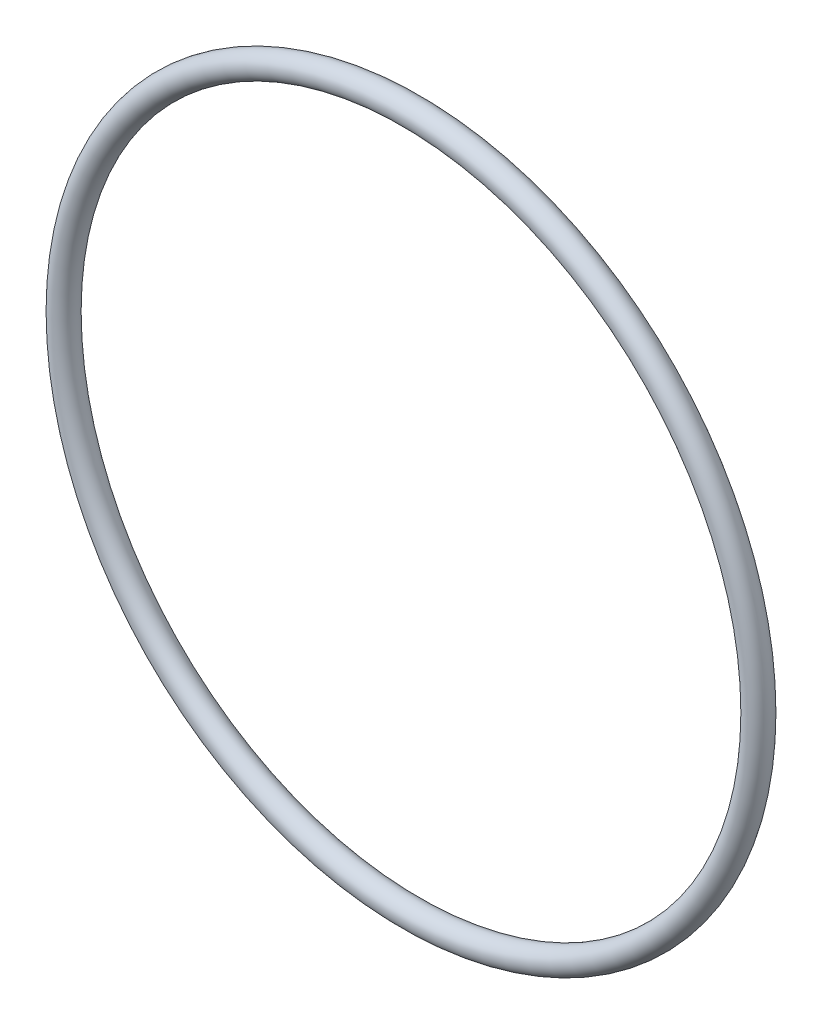
ISO-10303-21;
HEADER;
FILE_DESCRIPTION(('STEP AP214'),'2;1');
FILE_NAME('part.step','',(''),(''),'','','');
FILE_SCHEMA(('AUTOMOTIVE_DESIGN { 1 0 10303 214 1 1 1 1 }'));
ENDSEC;
DATA;
#1=APPLICATION_CONTEXT('core data for automotive mechanical design processes');
#2=APPLICATION_PROTOCOL_DEFINITION('international standard','automotive_design',2000,#1);
#3=PRODUCT_CONTEXT('',#1,'mechanical');
#4=PRODUCT('Part','Part','',(#3));
#5=PRODUCT_RELATED_PRODUCT_CATEGORY('part','',(#4));
#6=PRODUCT_DEFINITION_FORMATION('','',#4);
#7=PRODUCT_DEFINITION_CONTEXT('part definition',#1,'design');
#8=PRODUCT_DEFINITION('design','',#6,#7);
#9=PRODUCT_DEFINITION_SHAPE('','',#8);
#10=(LENGTH_UNIT() NAMED_UNIT(*) SI_UNIT(.MILLI.,.METRE.));
#11=(NAMED_UNIT(*) PLANE_ANGLE_UNIT() SI_UNIT($,.RADIAN.));
#12=(NAMED_UNIT(*) SI_UNIT($,.STERADIAN.) SOLID_ANGLE_UNIT());
#13=UNCERTAINTY_MEASURE_WITH_UNIT(LENGTH_MEASURE(1.E-05),#10,'distance_accuracy_value','');
#14=(GEOMETRIC_REPRESENTATION_CONTEXT(3) GLOBAL_UNCERTAINTY_ASSIGNED_CONTEXT((#13)) GLOBAL_UNIT_ASSIGNED_CONTEXT((#10,
#11,#12)) REPRESENTATION_CONTEXT('',''));
#15=CARTESIAN_POINT('',(0.,0.,0.));
#16=DIRECTION('',(0.,0.,1.));
#17=DIRECTION('',(1.,0.,0.));
#18=AXIS2_PLACEMENT_3D('',#15,#16,#17);
#19=CARTESIAN_POINT('',(0.,0.,0.9));
#20=DIRECTION('',(0.,0.,-1.));
#21=DIRECTION('',(-1.,0.,0.));
#22=AXIS2_PLACEMENT_3D('',#19,#20,#21);
#23=TOROIDAL_SURFACE('',#22,1.4,0.0499999999999999);
#24=CARTESIAN_POINT('',(-1.45,0.,0.9));
#25=VERTEX_POINT('',#24);
#26=VERTEX_LOOP('',#25);
#27=FACE_BOUND('',#26,.T.);
#28=ADVANCED_FACE('F13',(#27),#23,.T.);
#29=CLOSED_SHELL('',(#28));
#30=MANIFOLD_SOLID_BREP('B1',#29);
#31=ADVANCED_BREP_SHAPE_REPRESENTATION('',(#18,#30),#14);
#32=SHAPE_DEFINITION_REPRESENTATION(#9,#31);
ENDSEC;
END-ISO-10303-21;
